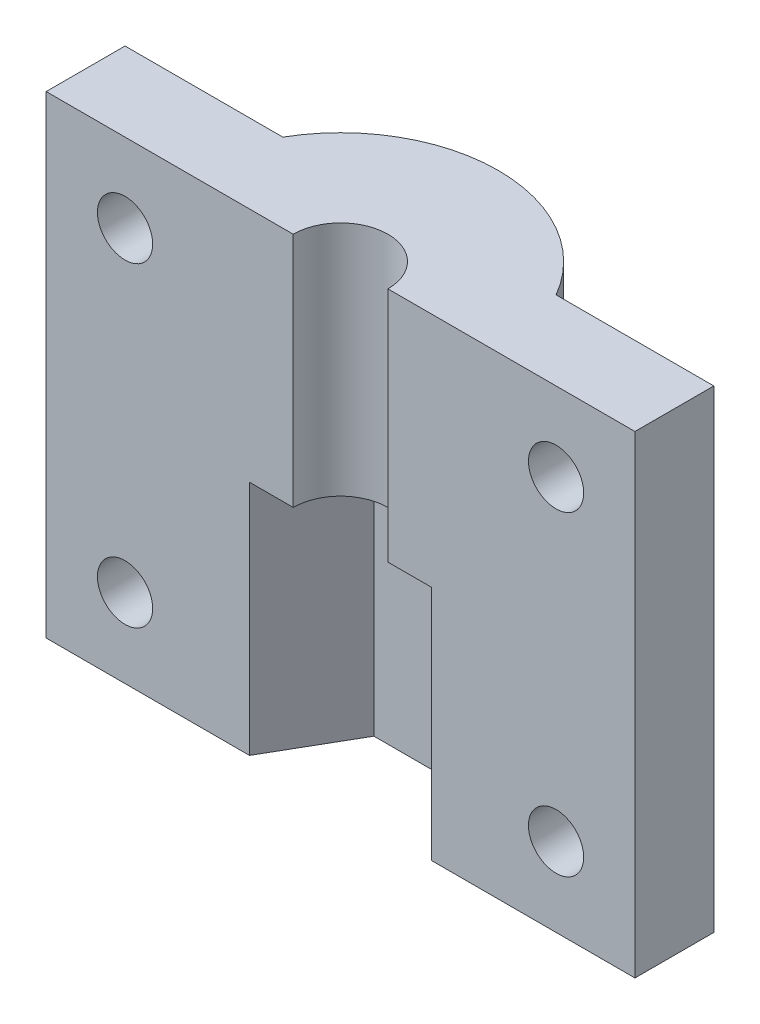
ISO-10303-21;
HEADER;
FILE_DESCRIPTION(('STEP AP214'),'2;1');
FILE_NAME('part.step','',(''),(''),'','','');
FILE_SCHEMA(('AUTOMOTIVE_DESIGN { 1 0 10303 214 1 1 1 1 }'));
ENDSEC;
DATA;
#1=APPLICATION_CONTEXT('core data for automotive mechanical design processes');
#2=APPLICATION_PROTOCOL_DEFINITION('international standard','automotive_design',2000,#1);
#3=PRODUCT_CONTEXT('',#1,'mechanical');
#4=PRODUCT('Part','Part','',(#3));
#5=PRODUCT_RELATED_PRODUCT_CATEGORY('part','',(#4));
#6=PRODUCT_DEFINITION_FORMATION('','',#4);
#7=PRODUCT_DEFINITION_CONTEXT('part definition',#1,'design');
#8=PRODUCT_DEFINITION('design','',#6,#7);
#9=PRODUCT_DEFINITION_SHAPE('','',#8);
#10=(LENGTH_UNIT() NAMED_UNIT(*) SI_UNIT(.MILLI.,.METRE.));
#11=(NAMED_UNIT(*) PLANE_ANGLE_UNIT() SI_UNIT($,.RADIAN.));
#12=(NAMED_UNIT(*) SI_UNIT($,.STERADIAN.) SOLID_ANGLE_UNIT());
#13=UNCERTAINTY_MEASURE_WITH_UNIT(LENGTH_MEASURE(1.E-05),#10,'distance_accuracy_value','');
#14=(GEOMETRIC_REPRESENTATION_CONTEXT(3) GLOBAL_UNCERTAINTY_ASSIGNED_CONTEXT((#13)) GLOBAL_UNIT_ASSIGNED_CONTEXT((#10,
#11,#12)) REPRESENTATION_CONTEXT('',''));
#15=CARTESIAN_POINT('',(0.,0.,0.));
#16=DIRECTION('',(0.,0.,1.));
#17=DIRECTION('',(1.,0.,0.));
#18=AXIS2_PLACEMENT_3D('',#15,#16,#17);
#19=CARTESIAN_POINT('',(-2.88675134594813,15.,-5.));
#20=DIRECTION('',(-0.866025403784439,0.,-0.5));
#21=DIRECTION('',(-0.5,0.,0.866025403784439));
#22=AXIS2_PLACEMENT_3D('',#19,#20,#21);
#23=PLANE('',#22);
#24=DIRECTION('',(0.5,0.,-0.866025403784439));
#25=VECTOR('',#24,1.);
#26=CARTESIAN_POINT('',(-2.88675134594813,0.,-5.));
#27=LINE('',#26,#25);
#28=CARTESIAN_POINT('',(-5.77350269189626,0.,0.));
#29=VERTEX_POINT('',#28);
#30=CARTESIAN_POINT('',(-2.88675134594813,0.,-5.));
#31=VERTEX_POINT('',#30);
#32=EDGE_CURVE('E193',#29,#31,#27,.T.);
#33=ORIENTED_EDGE('',*,*,#32,.T.);
#34=DIRECTION('',(0.,-1.,0.));
#35=VECTOR('',#34,1.);
#36=CARTESIAN_POINT('',(-2.88675134594813,15.,-5.));
#37=LINE('',#36,#35);
#38=CARTESIAN_POINT('',(-2.88675134594813,15.,-5.));
#39=VERTEX_POINT('',#38);
#40=EDGE_CURVE('E11',#39,#31,#37,.T.);
#41=ORIENTED_EDGE('',*,*,#40,.F.);
#42=DIRECTION('',(0.5,0.,-0.866025403784439));
#43=VECTOR('',#42,1.);
#44=CARTESIAN_POINT('',(-2.88675134594813,15.,-5.));
#45=LINE('',#44,#43);
#46=CARTESIAN_POINT('',(-5.77350269189626,15.,0.));
#47=VERTEX_POINT('',#46);
#48=EDGE_CURVE('E190',#47,#39,#45,.T.);
#49=ORIENTED_EDGE('',*,*,#48,.F.);
#50=DIRECTION('',(0.,-1.,0.));
#51=VECTOR('',#50,1.);
#52=CARTESIAN_POINT('',(-5.77350269189626,15.,0.));
#53=LINE('',#52,#51);
#54=EDGE_CURVE('E55',#47,#29,#53,.T.);
#55=ORIENTED_EDGE('',*,*,#54,.T.);
#56=EDGE_LOOP('',(#33,#41,#49,#55));
#57=FACE_BOUND('',#56,.T.);
#58=ADVANCED_FACE('F37',(#57),#23,.F.);
#59=CARTESIAN_POINT('',(2.88675134594813,15.,-5.));
#60=DIRECTION('',(0.,0.,-1.));
#61=DIRECTION('',(-1.,0.,0.));
#62=AXIS2_PLACEMENT_3D('',#59,#60,#61);
#63=PLANE('',#62);
#64=DIRECTION('',(1.,0.,0.));
#65=VECTOR('',#64,1.);
#66=CARTESIAN_POINT('',(2.88675134594813,0.,-5.));
#67=LINE('',#66,#65);
#68=CARTESIAN_POINT('',(2.88675134594813,0.,-5.));
#69=VERTEX_POINT('',#68);
#70=EDGE_CURVE('E259',#31,#69,#67,.T.);
#71=ORIENTED_EDGE('',*,*,#70,.T.);
#72=DIRECTION('',(0.,-1.,0.));
#73=VECTOR('',#72,1.);
#74=CARTESIAN_POINT('',(2.88675134594813,15.,-5.));
#75=LINE('',#74,#73);
#76=CARTESIAN_POINT('',(2.88675134594813,15.,-5.));
#77=VERTEX_POINT('',#76);
#78=EDGE_CURVE('E46',#77,#69,#75,.T.);
#79=ORIENTED_EDGE('',*,*,#78,.F.);
#80=DIRECTION('',(1.,0.,0.));
#81=VECTOR('',#80,1.);
#82=CARTESIAN_POINT('',(2.88675134594813,15.,-5.));
#83=LINE('',#82,#81);
#84=EDGE_CURVE('E99',#39,#77,#83,.T.);
#85=ORIENTED_EDGE('',*,*,#84,.F.);
#86=ORIENTED_EDGE('',*,*,#40,.T.);
#87=EDGE_LOOP('',(#71,#79,#85,#86));
#88=FACE_BOUND('',#87,.T.);
#89=ADVANCED_FACE('F250',(#88),#63,.F.);
#90=CARTESIAN_POINT('',(5.77350269189625,15.,0.));
#91=DIRECTION('',(0.866025403784439,0.,-0.5));
#92=DIRECTION('',(-0.5,0.,-0.866025403784439));
#93=AXIS2_PLACEMENT_3D('',#90,#91,#92);
#94=PLANE('',#93);
#95=DIRECTION('',(0.5,0.,0.866025403784439));
#96=VECTOR('',#95,1.);
#97=CARTESIAN_POINT('',(5.77350269189625,0.,0.));
#98=LINE('',#97,#96);
#99=CARTESIAN_POINT('',(5.77350269189625,0.,0.));
#100=VERTEX_POINT('',#99);
#101=EDGE_CURVE('E261',#69,#100,#98,.T.);
#102=ORIENTED_EDGE('',*,*,#101,.T.);
#103=DIRECTION('',(0.,-1.,0.));
#104=VECTOR('',#103,1.);
#105=CARTESIAN_POINT('',(5.77350269189625,15.,0.));
#106=LINE('',#105,#104);
#107=CARTESIAN_POINT('',(5.77350269189626,15.,0.));
#108=VERTEX_POINT('',#107);
#109=EDGE_CURVE('E281',#108,#100,#106,.T.);
#110=ORIENTED_EDGE('',*,*,#109,.F.);
#111=DIRECTION('',(0.5,0.,0.866025403784439));
#112=VECTOR('',#111,1.);
#113=CARTESIAN_POINT('',(5.77350269189625,15.,0.));
#114=LINE('',#113,#112);
#115=EDGE_CURVE('E189',#77,#108,#114,.T.);
#116=ORIENTED_EDGE('',*,*,#115,.F.);
#117=ORIENTED_EDGE('',*,*,#78,.T.);
#118=EDGE_LOOP('',(#102,#110,#116,#117));
#119=FACE_BOUND('',#118,.T.);
#120=ADVANCED_FACE('F255',(#119),#94,.F.);
#121=CARTESIAN_POINT('',(5.77350269189625,15.,0.));
#122=DIRECTION('',(0.,0.,-1.));
#123=DIRECTION('',(-1.,0.,0.));
#124=AXIS2_PLACEMENT_3D('',#121,#122,#123);
#125=PLANE('',#124);
#126=CARTESIAN_POINT('',(13.6602540378444,25.,0.));
#127=DIRECTION('',(0.,0.,-1.));
#128=DIRECTION('',(-1.,0.,0.));
#129=AXIS2_PLACEMENT_3D('',#126,#127,#128);
#130=CIRCLE('',#129,1.75);
#131=CARTESIAN_POINT('',(11.9102540378444,25.,0.));
#132=VERTEX_POINT('',#131);
#133=EDGE_CURVE('E215',#132,#132,#130,.T.);
#134=ORIENTED_EDGE('',*,*,#133,.T.);
#135=EDGE_LOOP('',(#134));
#136=FACE_BOUND('',#135,.T.);
#137=CARTESIAN_POINT('',(13.6602540378444,5.,0.));
#138=DIRECTION('',(0.,0.,-1.));
#139=DIRECTION('',(-1.,0.,0.));
#140=AXIS2_PLACEMENT_3D('',#137,#138,#139);
#141=CIRCLE('',#140,1.75);
#142=CARTESIAN_POINT('',(11.9102540378444,5.,0.));
#143=VERTEX_POINT('',#142);
#144=EDGE_CURVE('E166',#143,#143,#141,.T.);
#145=ORIENTED_EDGE('',*,*,#144,.T.);
#146=EDGE_LOOP('',(#145));
#147=FACE_BOUND('',#146,.T.);
#148=DIRECTION('',(1.,0.,0.));
#149=VECTOR('',#148,1.);
#150=CARTESIAN_POINT('',(5.77350269189625,0.,0.));
#151=LINE('',#150,#149);
#152=CARTESIAN_POINT('',(18.6602540378444,0.,0.));
#153=VERTEX_POINT('',#152);
#154=EDGE_CURVE('E303',#100,#153,#151,.T.);
#155=ORIENTED_EDGE('',*,*,#154,.T.);
#156=DIRECTION('',(0.,-1.,0.));
#157=VECTOR('',#156,1.);
#158=CARTESIAN_POINT('',(18.6602540378444,15.,0.));
#159=LINE('',#158,#157);
#160=CARTESIAN_POINT('',(18.6602540378444,30.,0.));
#161=VERTEX_POINT('',#160);
#162=EDGE_CURVE('E283',#161,#153,#159,.T.);
#163=ORIENTED_EDGE('',*,*,#162,.F.);
#164=DIRECTION('',(1.,0.,0.));
#165=VECTOR('',#164,1.);
#166=CARTESIAN_POINT('',(10.,30.,0.));
#167=LINE('',#166,#165);
#168=CARTESIAN_POINT('',(3.,30.,0.));
#169=VERTEX_POINT('',#168);
#170=EDGE_CURVE('E174',#169,#161,#167,.T.);
#171=ORIENTED_EDGE('',*,*,#170,.F.);
#172=DIRECTION('',(0.,-1.,0.));
#173=VECTOR('',#172,1.);
#174=CARTESIAN_POINT('',(3.,30.,0.));
#175=LINE('',#174,#173);
#176=CARTESIAN_POINT('',(3.,15.,0.));
#177=VERTEX_POINT('',#176);
#178=EDGE_CURVE('E180',#169,#177,#175,.T.);
#179=ORIENTED_EDGE('',*,*,#178,.T.);
#180=DIRECTION('',(1.,0.,0.));
#181=VECTOR('',#180,1.);
#182=CARTESIAN_POINT('',(18.6602540378444,15.,0.));
#183=LINE('',#182,#181);
#184=EDGE_CURVE('E160',#177,#108,#183,.T.);
#185=ORIENTED_EDGE('',*,*,#184,.T.);
#186=ORIENTED_EDGE('',*,*,#109,.T.);
#187=EDGE_LOOP('',(#155,#163,#171,#179,#185,#186));
#188=FACE_BOUND('',#187,.T.);
#189=ADVANCED_FACE('F233',(#136,#147,#188),#125,.F.);
#190=CARTESIAN_POINT('',(18.6602540378444,15.,0.));
#191=DIRECTION('',(-1.,0.,0.));
#192=DIRECTION('',(0.,0.,1.));
#193=AXIS2_PLACEMENT_3D('',#190,#191,#192);
#194=PLANE('',#193);
#195=DIRECTION('',(0.,0.,-1.));
#196=VECTOR('',#195,1.);
#197=CARTESIAN_POINT('',(18.6602540378444,0.,0.));
#198=LINE('',#197,#196);
#199=CARTESIAN_POINT('',(18.6602540378444,0.,-5.));
#200=VERTEX_POINT('',#199);
#201=EDGE_CURVE('E301',#153,#200,#198,.T.);
#202=ORIENTED_EDGE('',*,*,#201,.T.);
#203=DIRECTION('',(0.,-1.,0.));
#204=VECTOR('',#203,1.);
#205=CARTESIAN_POINT('',(18.6602540378444,15.,-5.));
#206=LINE('',#205,#204);
#207=CARTESIAN_POINT('',(18.6602540378444,30.,-5.));
#208=VERTEX_POINT('',#207);
#209=EDGE_CURVE('E286',#208,#200,#206,.T.);
#210=ORIENTED_EDGE('',*,*,#209,.F.);
#211=DIRECTION('',(0.,0.,-1.));
#212=VECTOR('',#211,1.);
#213=CARTESIAN_POINT('',(18.6602540378444,30.,-5.));
#214=LINE('',#213,#212);
#215=EDGE_CURVE('E177',#161,#208,#214,.T.);
#216=ORIENTED_EDGE('',*,*,#215,.F.);
#217=ORIENTED_EDGE('',*,*,#162,.T.);
#218=EDGE_LOOP('',(#202,#210,#216,#217));
#219=FACE_BOUND('',#218,.T.);
#220=ADVANCED_FACE('F308',(#219),#194,.F.);
#221=CARTESIAN_POINT('',(18.6602540378444,15.,-5.));
#222=DIRECTION('',(0.,0.,1.));
#223=DIRECTION('',(1.,0.,0.));
#224=AXIS2_PLACEMENT_3D('',#221,#222,#223);
#225=PLANE('',#224);
#226=CARTESIAN_POINT('',(13.6602540378444,25.,-4.99999999999999));
#227=DIRECTION('',(0.,0.,-1.));
#228=DIRECTION('',(1.,0.,0.));
#229=AXIS2_PLACEMENT_3D('',#226,#227,#228);
#230=CIRCLE('',#229,1.75);
#231=CARTESIAN_POINT('',(15.4102540378444,25.,-4.99999999999999));
#232=VERTEX_POINT('',#231);
#233=EDGE_CURVE('E210',#232,#232,#230,.T.);
#234=ORIENTED_EDGE('',*,*,#233,.F.);
#235=EDGE_LOOP('',(#234));
#236=FACE_BOUND('',#235,.T.);
#237=CARTESIAN_POINT('',(13.6602540378444,5.,-4.99999999999999));
#238=DIRECTION('',(0.,0.,-1.));
#239=DIRECTION('',(-1.,0.,0.));
#240=AXIS2_PLACEMENT_3D('',#237,#238,#239);
#241=CIRCLE('',#240,1.75);
#242=CARTESIAN_POINT('',(11.9102540378444,5.,-4.99999999999999));
#243=VERTEX_POINT('',#242);
#244=EDGE_CURVE('E226',#243,#243,#241,.T.);
#245=ORIENTED_EDGE('',*,*,#244,.F.);
#246=EDGE_LOOP('',(#245));
#247=FACE_BOUND('',#246,.T.);
#248=DIRECTION('',(-1.,0.,0.));
#249=VECTOR('',#248,1.);
#250=CARTESIAN_POINT('',(18.6602540378444,0.,-5.));
#251=LINE('',#250,#249);
#252=CARTESIAN_POINT('',(8.66025403784439,0.,-5.));
#253=VERTEX_POINT('',#252);
#254=EDGE_CURVE('E299',#200,#253,#251,.T.);
#255=ORIENTED_EDGE('',*,*,#254,.T.);
#256=DIRECTION('',(0.,-1.,0.));
#257=VECTOR('',#256,1.);
#258=CARTESIAN_POINT('',(8.66025403784439,15.,-5.));
#259=LINE('',#258,#257);
#260=CARTESIAN_POINT('',(8.66025403784439,30.,-5.));
#261=VERTEX_POINT('',#260);
#262=EDGE_CURVE('E144',#261,#253,#259,.T.);
#263=ORIENTED_EDGE('',*,*,#262,.F.);
#264=DIRECTION('',(-1.,0.,0.));
#265=VECTOR('',#264,1.);
#266=CARTESIAN_POINT('',(8.66025403784439,30.,-5.));
#267=LINE('',#266,#265);
#268=EDGE_CURVE('E159',#208,#261,#267,.T.);
#269=ORIENTED_EDGE('',*,*,#268,.F.);
#270=ORIENTED_EDGE('',*,*,#209,.T.);
#271=EDGE_LOOP('',(#255,#263,#269,#270));
#272=FACE_BOUND('',#271,.T.);
#273=ADVANCED_FACE('F312',(#236,#247,#272),#225,.F.);
#274=CARTESIAN_POINT('',(0.,15.,0.));
#275=DIRECTION('',(0.,-1.,0.));
#276=DIRECTION('',(0.,0.,-1.));
#277=AXIS2_PLACEMENT_3D('',#274,#275,#276);
#278=CYLINDRICAL_SURFACE('',#277,10.);
#279=CARTESIAN_POINT('',(0.,0.,0.));
#280=DIRECTION('',(0.,1.,0.));
#281=DIRECTION('',(0.,0.,1.));
#282=AXIS2_PLACEMENT_3D('',#279,#280,#281);
#283=CIRCLE('',#282,10.);
#284=CARTESIAN_POINT('',(-8.66025403784439,0.,-5.));
#285=VERTEX_POINT('',#284);
#286=EDGE_CURVE('E141',#253,#285,#283,.T.);
#287=ORIENTED_EDGE('',*,*,#286,.T.);
#288=DIRECTION('',(0.,-1.,0.));
#289=VECTOR('',#288,1.);
#290=CARTESIAN_POINT('',(-8.66025403784439,15.,-5.));
#291=LINE('',#290,#289);
#292=CARTESIAN_POINT('',(-8.66025403784439,30.,-5.));
#293=VERTEX_POINT('',#292);
#294=EDGE_CURVE('E134',#293,#285,#291,.T.);
#295=ORIENTED_EDGE('',*,*,#294,.F.);
#296=CARTESIAN_POINT('',(0.,30.,0.));
#297=DIRECTION('',(0.,1.,0.));
#298=DIRECTION('',(0.,0.,1.));
#299=AXIS2_PLACEMENT_3D('',#296,#297,#298);
#300=CIRCLE('',#299,10.);
#301=EDGE_CURVE('E139',#261,#293,#300,.T.);
#302=ORIENTED_EDGE('',*,*,#301,.F.);
#303=ORIENTED_EDGE('',*,*,#262,.T.);
#304=EDGE_LOOP('',(#287,#295,#302,#303));
#305=FACE_BOUND('',#304,.T.);
#306=ADVANCED_FACE('F136',(#305),#278,.T.);
#307=CARTESIAN_POINT('',(-18.6602540378444,15.,-5.));
#308=DIRECTION('',(0.,0.,1.));
#309=DIRECTION('',(1.,0.,0.));
#310=AXIS2_PLACEMENT_3D('',#307,#308,#309);
#311=PLANE('',#310);
#312=CARTESIAN_POINT('',(-13.6602540378444,25.,-4.99999999999999));
#313=DIRECTION('',(0.,0.,-1.));
#314=DIRECTION('',(-1.,0.,0.));
#315=AXIS2_PLACEMENT_3D('',#312,#313,#314);
#316=CIRCLE('',#315,1.75);
#317=CARTESIAN_POINT('',(-15.4102540378444,25.,-4.99999999999999));
#318=VERTEX_POINT('',#317);
#319=EDGE_CURVE('E222',#318,#318,#316,.T.);
#320=ORIENTED_EDGE('',*,*,#319,.F.);
#321=EDGE_LOOP('',(#320));
#322=FACE_BOUND('',#321,.T.);
#323=CARTESIAN_POINT('',(-13.6602540378444,5.,-4.99999999999999));
#324=DIRECTION('',(0.,0.,-1.));
#325=DIRECTION('',(1.,0.,0.));
#326=AXIS2_PLACEMENT_3D('',#323,#324,#325);
#327=CIRCLE('',#326,1.75);
#328=CARTESIAN_POINT('',(-11.9102540378444,5.,-4.99999999999999));
#329=VERTEX_POINT('',#328);
#330=EDGE_CURVE('E211',#329,#329,#327,.T.);
#331=ORIENTED_EDGE('',*,*,#330,.F.);
#332=EDGE_LOOP('',(#331));
#333=FACE_BOUND('',#332,.T.);
#334=DIRECTION('',(-1.,0.,0.));
#335=VECTOR('',#334,1.);
#336=CARTESIAN_POINT('',(-18.6602540378444,0.,-5.));
#337=LINE('',#336,#335);
#338=CARTESIAN_POINT('',(-18.6602540378444,0.,-5.));
#339=VERTEX_POINT('',#338);
#340=EDGE_CURVE('E296',#285,#339,#337,.T.);
#341=ORIENTED_EDGE('',*,*,#340,.T.);
#342=DIRECTION('',(0.,-1.,0.));
#343=VECTOR('',#342,1.);
#344=CARTESIAN_POINT('',(-18.6602540378444,15.,-5.));
#345=LINE('',#344,#343);
#346=CARTESIAN_POINT('',(-18.6602540378444,30.,-5.));
#347=VERTEX_POINT('',#346);
#348=EDGE_CURVE('E145',#347,#339,#345,.T.);
#349=ORIENTED_EDGE('',*,*,#348,.F.);
#350=DIRECTION('',(-1.,0.,0.));
#351=VECTOR('',#350,1.);
#352=CARTESIAN_POINT('',(-18.6602540378444,30.,-5.));
#353=LINE('',#352,#351);
#354=EDGE_CURVE('E148',#293,#347,#353,.T.);
#355=ORIENTED_EDGE('',*,*,#354,.F.);
#356=ORIENTED_EDGE('',*,*,#294,.T.);
#357=EDGE_LOOP('',(#341,#349,#355,#356));
#358=FACE_BOUND('',#357,.T.);
#359=ADVANCED_FACE('F149',(#322,#333,#358),#311,.F.);
#360=CARTESIAN_POINT('',(-18.6602540378444,15.,0.));
#361=DIRECTION('',(1.,0.,0.));
#362=DIRECTION('',(0.,0.,-1.));
#363=AXIS2_PLACEMENT_3D('',#360,#361,#362);
#364=PLANE('',#363);
#365=DIRECTION('',(0.,0.,1.));
#366=VECTOR('',#365,1.);
#367=CARTESIAN_POINT('',(-18.6602540378444,0.,0.));
#368=LINE('',#367,#366);
#369=CARTESIAN_POINT('',(-18.6602540378444,0.,0.));
#370=VERTEX_POINT('',#369);
#371=EDGE_CURVE('E92',#339,#370,#368,.T.);
#372=ORIENTED_EDGE('',*,*,#371,.T.);
#373=DIRECTION('',(0.,-1.,0.));
#374=VECTOR('',#373,1.);
#375=CARTESIAN_POINT('',(-18.6602540378444,15.,0.));
#376=LINE('',#375,#374);
#377=CARTESIAN_POINT('',(-18.6602540378444,30.,0.));
#378=VERTEX_POINT('',#377);
#379=EDGE_CURVE('E202',#378,#370,#376,.T.);
#380=ORIENTED_EDGE('',*,*,#379,.F.);
#381=DIRECTION('',(0.,0.,1.));
#382=VECTOR('',#381,1.);
#383=CARTESIAN_POINT('',(-18.6602540378444,30.,-5.));
#384=LINE('',#383,#382);
#385=EDGE_CURVE('E153',#347,#378,#384,.T.);
#386=ORIENTED_EDGE('',*,*,#385,.F.);
#387=ORIENTED_EDGE('',*,*,#348,.T.);
#388=EDGE_LOOP('',(#372,#380,#386,#387));
#389=FACE_BOUND('',#388,.T.);
#390=ADVANCED_FACE('F316',(#389),#364,.F.);
#391=CARTESIAN_POINT('',(-5.77350269189626,15.,0.));
#392=DIRECTION('',(0.,0.,-1.));
#393=DIRECTION('',(-1.,0.,0.));
#394=AXIS2_PLACEMENT_3D('',#391,#392,#393);
#395=PLANE('',#394);
#396=CARTESIAN_POINT('',(-13.6602540378444,25.,0.));
#397=DIRECTION('',(0.,0.,-1.));
#398=DIRECTION('',(-1.,0.,0.));
#399=AXIS2_PLACEMENT_3D('',#396,#397,#398);
#400=CIRCLE('',#399,1.75);
#401=CARTESIAN_POINT('',(-15.4102540378444,25.,0.));
#402=VERTEX_POINT('',#401);
#403=EDGE_CURVE('E40',#402,#402,#400,.T.);
#404=ORIENTED_EDGE('',*,*,#403,.T.);
#405=EDGE_LOOP('',(#404));
#406=FACE_BOUND('',#405,.T.);
#407=CARTESIAN_POINT('',(-13.6602540378444,5.,0.));
#408=DIRECTION('',(0.,0.,-1.));
#409=DIRECTION('',(-1.,0.,0.));
#410=AXIS2_PLACEMENT_3D('',#407,#408,#409);
#411=CIRCLE('',#410,1.75);
#412=CARTESIAN_POINT('',(-15.4102540378444,5.,0.));
#413=VERTEX_POINT('',#412);
#414=EDGE_CURVE('E208',#413,#413,#411,.T.);
#415=ORIENTED_EDGE('',*,*,#414,.T.);
#416=EDGE_LOOP('',(#415));
#417=FACE_BOUND('',#416,.T.);
#418=DIRECTION('',(1.,0.,0.));
#419=VECTOR('',#418,1.);
#420=CARTESIAN_POINT('',(-5.77350269189626,0.,0.));
#421=LINE('',#420,#419);
#422=EDGE_CURVE('E95',#370,#29,#421,.T.);
#423=ORIENTED_EDGE('',*,*,#422,.T.);
#424=ORIENTED_EDGE('',*,*,#54,.F.);
#425=DIRECTION('',(1.,0.,0.));
#426=VECTOR('',#425,1.);
#427=CARTESIAN_POINT('',(-18.6602540378444,15.,0.));
#428=LINE('',#427,#426);
#429=CARTESIAN_POINT('',(-3.,15.,0.));
#430=VERTEX_POINT('',#429);
#431=EDGE_CURVE('E185',#47,#430,#428,.T.);
#432=ORIENTED_EDGE('',*,*,#431,.T.);
#433=DIRECTION('',(0.,-1.,0.));
#434=VECTOR('',#433,1.);
#435=CARTESIAN_POINT('',(-3.,30.,0.));
#436=LINE('',#435,#434);
#437=CARTESIAN_POINT('',(-3.,30.,0.));
#438=VERTEX_POINT('',#437);
#439=EDGE_CURVE('E260',#438,#430,#436,.T.);
#440=ORIENTED_EDGE('',*,*,#439,.F.);
#441=DIRECTION('',(1.,0.,0.));
#442=VECTOR('',#441,1.);
#443=CARTESIAN_POINT('',(-18.6602540378444,30.,0.));
#444=LINE('',#443,#442);
#445=EDGE_CURVE('E170',#378,#438,#444,.T.);
#446=ORIENTED_EDGE('',*,*,#445,.F.);
#447=ORIENTED_EDGE('',*,*,#379,.T.);
#448=EDGE_LOOP('',(#423,#424,#432,#440,#446,#447));
#449=FACE_BOUND('',#448,.T.);
#450=ADVANCED_FACE('F314',(#406,#417,#449),#395,.F.);
#451=CARTESIAN_POINT('',(0.,0.,0.));
#452=DIRECTION('',(0.,1.,0.));
#453=DIRECTION('',(0.,0.,1.));
#454=AXIS2_PLACEMENT_3D('',#451,#452,#453);
#455=PLANE('',#454);
#456=ORIENTED_EDGE('',*,*,#32,.F.);
#457=ORIENTED_EDGE('',*,*,#422,.F.);
#458=ORIENTED_EDGE('',*,*,#371,.F.);
#459=ORIENTED_EDGE('',*,*,#340,.F.);
#460=ORIENTED_EDGE('',*,*,#286,.F.);
#461=ORIENTED_EDGE('',*,*,#254,.F.);
#462=ORIENTED_EDGE('',*,*,#201,.F.);
#463=ORIENTED_EDGE('',*,*,#154,.F.);
#464=ORIENTED_EDGE('',*,*,#101,.F.);
#465=ORIENTED_EDGE('',*,*,#70,.F.);
#466=EDGE_LOOP('',(#456,#457,#458,#459,#460,#461,#462,#463,#464,#465));
#467=FACE_BOUND('',#466,.T.);
#468=ADVANCED_FACE('F310',(#467),#455,.F.);
#469=CARTESIAN_POINT('',(0.,15.,0.));
#470=DIRECTION('',(0.,1.,0.));
#471=DIRECTION('',(0.,0.,1.));
#472=AXIS2_PLACEMENT_3D('',#469,#470,#471);
#473=PLANE('',#472);
#474=ORIENTED_EDGE('',*,*,#431,.F.);
#475=ORIENTED_EDGE('',*,*,#48,.T.);
#476=ORIENTED_EDGE('',*,*,#84,.T.);
#477=ORIENTED_EDGE('',*,*,#115,.T.);
#478=ORIENTED_EDGE('',*,*,#184,.F.);
#479=CARTESIAN_POINT('',(0.,15.,0.));
#480=DIRECTION('',(0.,-1.,0.));
#481=DIRECTION('',(0.,0.,1.));
#482=AXIS2_PLACEMENT_3D('',#479,#480,#481);
#483=CIRCLE('',#482,3.);
#484=EDGE_CURVE('E163',#430,#177,#483,.T.);
#485=ORIENTED_EDGE('',*,*,#484,.F.);
#486=EDGE_LOOP('',(#474,#475,#476,#477,#478,#485));
#487=FACE_BOUND('',#486,.T.);
#488=ADVANCED_FACE('F276',(#487),#473,.F.);
#489=CARTESIAN_POINT('',(0.,30.,0.));
#490=DIRECTION('',(0.,-1.,0.));
#491=DIRECTION('',(0.,0.,-1.));
#492=AXIS2_PLACEMENT_3D('',#489,#490,#491);
#493=CYLINDRICAL_SURFACE('',#492,3.);
#494=ORIENTED_EDGE('',*,*,#484,.T.);
#495=ORIENTED_EDGE('',*,*,#178,.F.);
#496=CARTESIAN_POINT('',(0.,30.,0.));
#497=DIRECTION('',(0.,-1.,0.));
#498=DIRECTION('',(0.,0.,1.));
#499=AXIS2_PLACEMENT_3D('',#496,#497,#498);
#500=CIRCLE('',#499,3.);
#501=EDGE_CURVE('E172',#438,#169,#500,.T.);
#502=ORIENTED_EDGE('',*,*,#501,.F.);
#503=ORIENTED_EDGE('',*,*,#439,.T.);
#504=EDGE_LOOP('',(#494,#495,#502,#503));
#505=FACE_BOUND('',#504,.T.);
#506=ADVANCED_FACE('F247',(#505),#493,.F.);
#507=CARTESIAN_POINT('',(0.,30.,0.));
#508=DIRECTION('',(0.,1.,0.));
#509=DIRECTION('',(0.,0.,1.));
#510=AXIS2_PLACEMENT_3D('',#507,#508,#509);
#511=PLANE('',#510);
#512=ORIENTED_EDGE('',*,*,#301,.T.);
#513=ORIENTED_EDGE('',*,*,#354,.T.);
#514=ORIENTED_EDGE('',*,*,#385,.T.);
#515=ORIENTED_EDGE('',*,*,#445,.T.);
#516=ORIENTED_EDGE('',*,*,#501,.T.);
#517=ORIENTED_EDGE('',*,*,#170,.T.);
#518=ORIENTED_EDGE('',*,*,#215,.T.);
#519=ORIENTED_EDGE('',*,*,#268,.T.);
#520=EDGE_LOOP('',(#512,#513,#514,#515,#516,#517,#518,#519));
#521=FACE_BOUND('',#520,.T.);
#522=ADVANCED_FACE('F156',(#521),#511,.T.);
#523=CARTESIAN_POINT('',(13.6602540378444,5.,5.00000000014378E-05));
#524=DIRECTION('',(0.,0.,-1.));
#525=DIRECTION('',(-1.,0.,0.));
#526=AXIS2_PLACEMENT_3D('',#523,#524,#525);
#527=CYLINDRICAL_SURFACE('',#526,1.75);
#528=ORIENTED_EDGE('',*,*,#244,.T.);
#529=EDGE_LOOP('',(#528));
#530=FACE_BOUND('',#529,.T.);
#531=ORIENTED_EDGE('',*,*,#144,.F.);
#532=EDGE_LOOP('',(#531));
#533=FACE_BOUND('',#532,.T.);
#534=ADVANCED_FACE('F236',(#530,#533),#527,.F.);
#535=CARTESIAN_POINT('',(13.6602540378444,25.,5.00000000014378E-05));
#536=DIRECTION('',(0.,0.,-1.));
#537=DIRECTION('',(-1.,0.,0.));
#538=AXIS2_PLACEMENT_3D('',#535,#536,#537);
#539=CYLINDRICAL_SURFACE('',#538,1.75);
#540=ORIENTED_EDGE('',*,*,#233,.T.);
#541=EDGE_LOOP('',(#540));
#542=FACE_BOUND('',#541,.T.);
#543=ORIENTED_EDGE('',*,*,#133,.F.);
#544=EDGE_LOOP('',(#543));
#545=FACE_BOUND('',#544,.T.);
#546=ADVANCED_FACE('F238',(#542,#545),#539,.F.);
#547=CARTESIAN_POINT('',(-13.6602540378444,5.,4.99999999997031E-05));
#548=DIRECTION('',(0.,0.,-1.));
#549=DIRECTION('',(-1.,0.,0.));
#550=AXIS2_PLACEMENT_3D('',#547,#548,#549);
#551=CYLINDRICAL_SURFACE('',#550,1.75);
#552=ORIENTED_EDGE('',*,*,#330,.T.);
#553=EDGE_LOOP('',(#552));
#554=FACE_BOUND('',#553,.T.);
#555=ORIENTED_EDGE('',*,*,#414,.F.);
#556=EDGE_LOOP('',(#555));
#557=FACE_BOUND('',#556,.T.);
#558=ADVANCED_FACE('F244',(#554,#557),#551,.F.);
#559=CARTESIAN_POINT('',(-13.6602540378444,25.,4.99999999997031E-05));
#560=DIRECTION('',(0.,0.,-1.));
#561=DIRECTION('',(-1.,0.,0.));
#562=AXIS2_PLACEMENT_3D('',#559,#560,#561);
#563=CYLINDRICAL_SURFACE('',#562,1.75);
#564=ORIENTED_EDGE('',*,*,#319,.T.);
#565=EDGE_LOOP('',(#564));
#566=FACE_BOUND('',#565,.T.);
#567=ORIENTED_EDGE('',*,*,#403,.F.);
#568=EDGE_LOOP('',(#567));
#569=FACE_BOUND('',#568,.T.);
#570=ADVANCED_FACE('F411',(#566,#569),#563,.F.);
#571=CLOSED_SHELL('',(#58,#89,#120,#189,#220,#273,#306,#359,#390,#450,#468,#488,#506,#522,#534,
#546,#558,#570));
#572=MANIFOLD_SOLID_BREP('B2',#571);
#573=ADVANCED_BREP_SHAPE_REPRESENTATION('',(#18,#572),#14);
#574=SHAPE_DEFINITION_REPRESENTATION(#9,#573);
ENDSEC;
END-ISO-10303-21;
